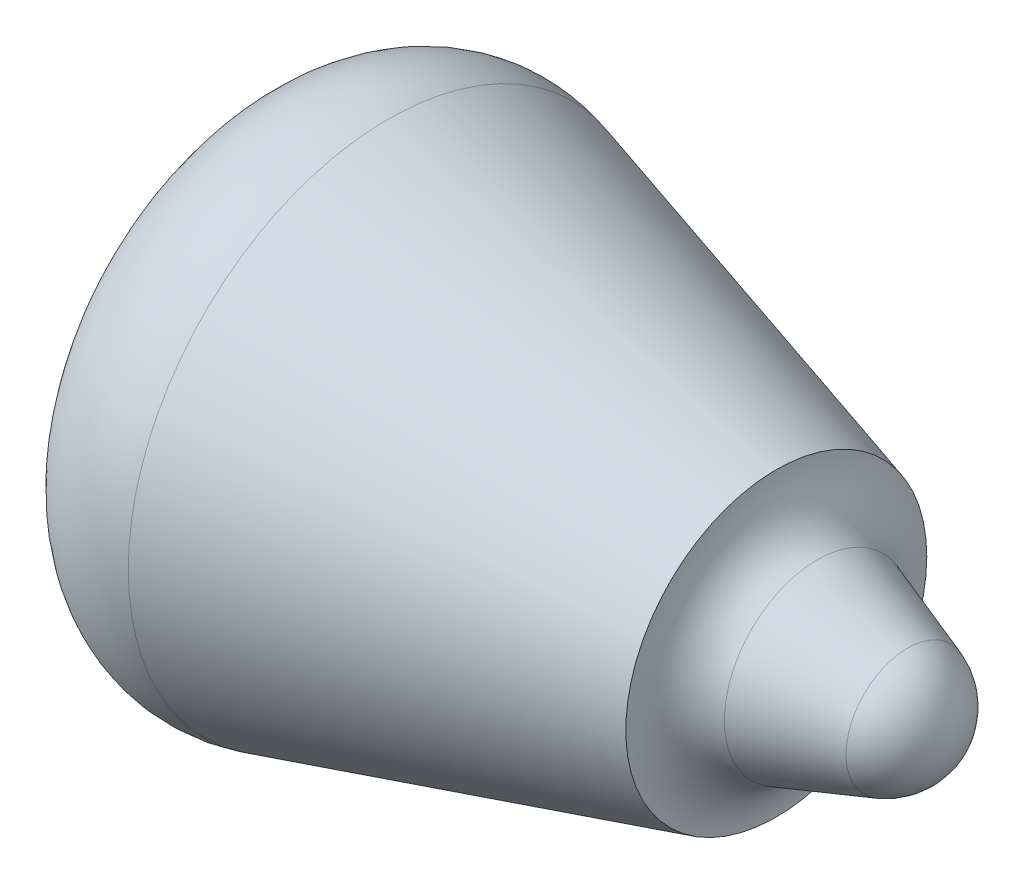
ISO-10303-21;
HEADER;
FILE_DESCRIPTION(('STEP AP214'),'2;1');
FILE_NAME('part.step','',(''),(''),'','','');
FILE_SCHEMA(('AUTOMOTIVE_DESIGN { 1 0 10303 214 1 1 1 1 }'));
ENDSEC;
DATA;
#1=APPLICATION_CONTEXT('core data for automotive mechanical design processes');
#2=APPLICATION_PROTOCOL_DEFINITION('international standard','automotive_design',2000,#1);
#3=PRODUCT_CONTEXT('',#1,'mechanical');
#4=PRODUCT('Part','Part','',(#3));
#5=PRODUCT_RELATED_PRODUCT_CATEGORY('part','',(#4));
#6=PRODUCT_DEFINITION_FORMATION('','',#4);
#7=PRODUCT_DEFINITION_CONTEXT('part definition',#1,'design');
#8=PRODUCT_DEFINITION('design','',#6,#7);
#9=PRODUCT_DEFINITION_SHAPE('','',#8);
#10=(LENGTH_UNIT() NAMED_UNIT(*) SI_UNIT(.MILLI.,.METRE.));
#11=(NAMED_UNIT(*) PLANE_ANGLE_UNIT() SI_UNIT($,.RADIAN.));
#12=(NAMED_UNIT(*) SI_UNIT($,.STERADIAN.) SOLID_ANGLE_UNIT());
#13=UNCERTAINTY_MEASURE_WITH_UNIT(LENGTH_MEASURE(1.E-05),#10,'distance_accuracy_value','');
#14=(GEOMETRIC_REPRESENTATION_CONTEXT(3) GLOBAL_UNCERTAINTY_ASSIGNED_CONTEXT((#13)) GLOBAL_UNIT_ASSIGNED_CONTEXT((#10,
#11,#12)) REPRESENTATION_CONTEXT('',''));
#15=CARTESIAN_POINT('',(0.,0.,0.));
#16=DIRECTION('',(0.,0.,1.));
#17=DIRECTION('',(1.,0.,0.));
#18=AXIS2_PLACEMENT_3D('',#15,#16,#17);
#19=CARTESIAN_POINT('',(84.,0.,0.));
#20=DIRECTION('',(1.,0.,0.));
#21=DIRECTION('',(0.,0.,-1.));
#22=AXIS2_PLACEMENT_3D('',#19,#20,#21);
#23=TOROIDAL_SURFACE('',#22,111.,84.);
#24=CARTESIAN_POINT('',(0.,0.,0.));
#25=DIRECTION('',(1.,0.,0.));
#26=DIRECTION('',(0.,0.,-1.));
#27=AXIS2_PLACEMENT_3D('',#24,#25,#26);
#28=CIRCLE('',#27,111.);
#29=CARTESIAN_POINT('',(0.,0.,-111.));
#30=VERTEX_POINT('',#29);
#31=EDGE_CURVE('E10',#30,#30,#28,.T.);
#32=ORIENTED_EDGE('',*,*,#31,.T.);
#33=EDGE_LOOP('',(#32));
#34=FACE_BOUND('',#33,.T.);
#35=CARTESIAN_POINT('',(106.834951456311,0.,0.));
#36=DIRECTION('',(1.,0.,0.));
#37=DIRECTION('',(0.,0.,-1.));
#38=AXIS2_PLACEMENT_3D('',#35,#36,#37);
#39=CIRCLE('',#38,191.83665623953);
#40=CARTESIAN_POINT('',(106.834951456311,0.,-191.83665623953));
#41=VERTEX_POINT('',#40);
#42=EDGE_CURVE('E54',#41,#41,#39,.T.);
#43=ORIENTED_EDGE('',*,*,#42,.F.);
#44=EDGE_LOOP('',(#43));
#45=FACE_BOUND('',#44,.T.);
#46=ADVANCED_FACE('F35',(#34,#45),#23,.T.);
#47=CARTESIAN_POINT('',(0.,111.,0.));
#48=DIRECTION('',(-1.,0.,0.));
#49=DIRECTION('',(0.,0.,1.));
#50=AXIS2_PLACEMENT_3D('',#47,#48,#49);
#51=PLANE('',#50);
#52=ORIENTED_EDGE('',*,*,#31,.F.);
#53=EDGE_LOOP('',(#52));
#54=FACE_BOUND('',#53,.T.);
#55=ADVANCED_FACE('F62',(#54),#51,.T.);
#56=CARTESIAN_POINT('',(474.,0.,0.));
#57=DIRECTION('',(1.,0.,0.));
#58=DIRECTION('',(0.,-1.,0.));
#59=AXIS2_PLACEMENT_3D('',#56,#57,#58);
#60=SPHERICAL_SURFACE('',#59,48.);
#61=CARTESIAN_POINT('',(489.776967694726,0.,0.));
#62=DIRECTION('',(1.,0.,0.));
#63=DIRECTION('',(0.,0.,-1.));
#64=AXIS2_PLACEMENT_3D('',#61,#62,#63);
#65=CIRCLE('',#64,45.3330706036948);
#66=CARTESIAN_POINT('',(489.776967694726,0.,-45.3330706036948));
#67=VERTEX_POINT('',#66);
#68=EDGE_CURVE('E41',#67,#67,#65,.T.);
#69=ORIENTED_EDGE('',*,*,#68,.T.);
#70=EDGE_LOOP('',(#69));
#71=FACE_BOUND('',#70,.T.);
#72=ADVANCED_FACE('F66',(#71),#60,.T.);
#73=CARTESIAN_POINT('',(489.776967694726,0.,0.));
#74=DIRECTION('',(-1.,0.,0.));
#75=DIRECTION('',(0.,0.,1.));
#76=AXIS2_PLACEMENT_3D('',#73,#74,#75);
#77=CONICAL_SURFACE('',#76,45.3330706036948,0.334912811571314);
#78=CARTESIAN_POINT('',(423.209092786195,0.,0.));
#79=DIRECTION('',(1.,0.,0.));
#80=DIRECTION('',(0.,0.,-1.));
#81=AXIS2_PLACEMENT_3D('',#78,#79,#80);
#82=CIRCLE('',#81,68.5002463090361);
#83=CARTESIAN_POINT('',(423.209092786195,0.,-68.5002463090361));
#84=VERTEX_POINT('',#83);
#85=EDGE_CURVE('E45',#84,#84,#82,.T.);
#86=ORIENTED_EDGE('',*,*,#85,.T.);
#87=EDGE_LOOP('',(#86));
#88=FACE_BOUND('',#87,.T.);
#89=ORIENTED_EDGE('',*,*,#68,.F.);
#90=EDGE_LOOP('',(#89));
#91=FACE_BOUND('',#90,.T.);
#92=ADVANCED_FACE('F71',(#88,#91),#77,.T.);
#93=CARTESIAN_POINT('',(438.,0.,0.));
#94=DIRECTION('',(1.,0.,0.));
#95=DIRECTION('',(0.,0.,-1.));
#96=AXIS2_PLACEMENT_3D('',#93,#94,#95);
#97=TOROIDAL_SURFACE('',#96,111.,45.);
#98=CARTESIAN_POINT('',(393.,0.,0.));
#99=DIRECTION('',(1.,0.,0.));
#100=DIRECTION('',(0.,0.,-1.));
#101=AXIS2_PLACEMENT_3D('',#98,#99,#100);
#102=CIRCLE('',#101,111.);
#103=CARTESIAN_POINT('',(393.,0.,-111.));
#104=VERTEX_POINT('',#103);
#105=EDGE_CURVE('E49',#104,#104,#102,.T.);
#106=ORIENTED_EDGE('',*,*,#105,.T.);
#107=EDGE_LOOP('',(#106));
#108=FACE_BOUND('',#107,.T.);
#109=ORIENTED_EDGE('',*,*,#85,.F.);
#110=EDGE_LOOP('',(#109));
#111=FACE_BOUND('',#110,.T.);
#112=ADVANCED_FACE('F76',(#108,#111),#97,.F.);
#113=CARTESIAN_POINT('',(393.,0.,0.));
#114=DIRECTION('',(-1.,0.,0.));
#115=DIRECTION('',(0.,0.,1.));
#116=AXIS2_PLACEMENT_3D('',#113,#114,#115);
#117=CONICAL_SURFACE('',#116,111.,0.275309360392464);
#118=ORIENTED_EDGE('',*,*,#42,.T.);
#119=EDGE_LOOP('',(#118));
#120=FACE_BOUND('',#119,.T.);
#121=ORIENTED_EDGE('',*,*,#105,.F.);
#122=EDGE_LOOP('',(#121));
#123=FACE_BOUND('',#122,.T.);
#124=ADVANCED_FACE('F58',(#120,#123),#117,.T.);
#125=CLOSED_SHELL('',(#46,#55,#72,#92,#112,#124));
#126=MANIFOLD_SOLID_BREP('B2',#125);
#127=ADVANCED_BREP_SHAPE_REPRESENTATION('',(#18,#126),#14);
#128=SHAPE_DEFINITION_REPRESENTATION(#9,#127);
ENDSEC;
END-ISO-10303-21;
